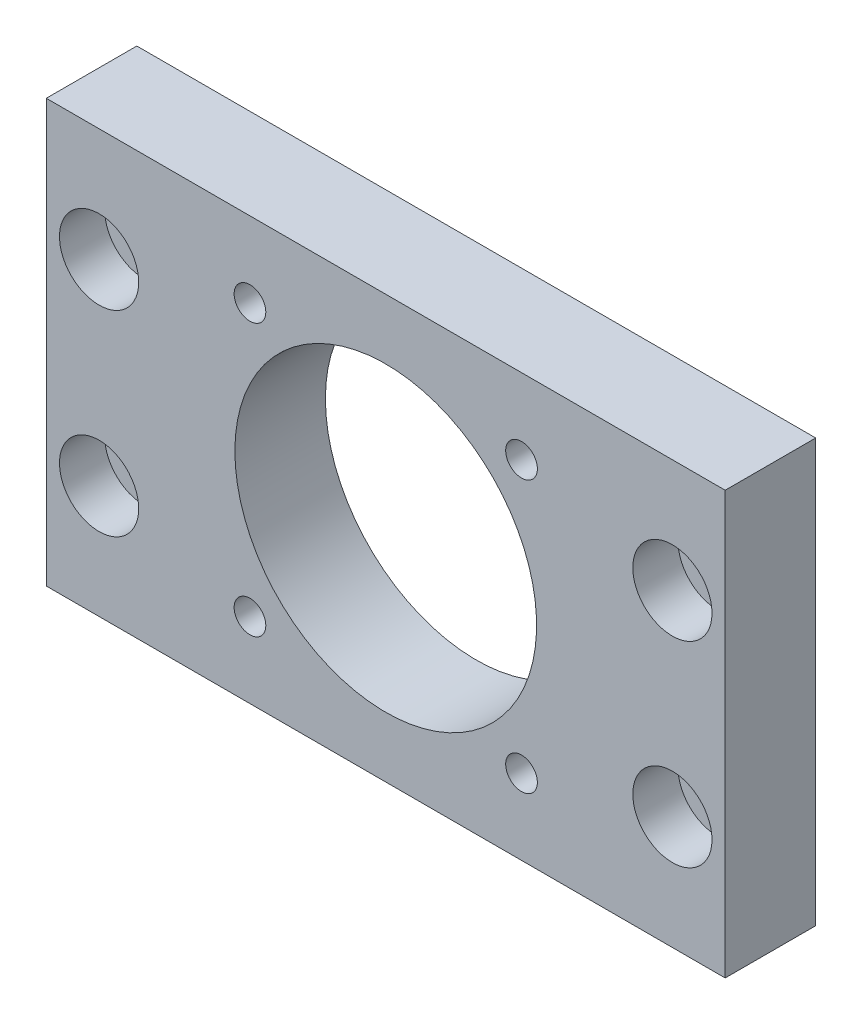
ISO-10303-21;
HEADER;
FILE_DESCRIPTION(('STEP AP214'),'2;1');
FILE_NAME('part.step','',(''),(''),'','','');
FILE_SCHEMA(('AUTOMOTIVE_DESIGN { 1 0 10303 214 1 1 1 1 }'));
ENDSEC;
DATA;
#1=APPLICATION_CONTEXT('core data for automotive mechanical design processes');
#2=APPLICATION_PROTOCOL_DEFINITION('international standard','automotive_design',2000,#1);
#3=PRODUCT_CONTEXT('',#1,'mechanical');
#4=PRODUCT('Part','Part','',(#3));
#5=PRODUCT_RELATED_PRODUCT_CATEGORY('part','',(#4));
#6=PRODUCT_DEFINITION_FORMATION('','',#4);
#7=PRODUCT_DEFINITION_CONTEXT('part definition',#1,'design');
#8=PRODUCT_DEFINITION('design','',#6,#7);
#9=PRODUCT_DEFINITION_SHAPE('','',#8);
#10=(LENGTH_UNIT() NAMED_UNIT(*) SI_UNIT(.MILLI.,.METRE.));
#11=(NAMED_UNIT(*) PLANE_ANGLE_UNIT() SI_UNIT($,.RADIAN.));
#12=(NAMED_UNIT(*) SI_UNIT($,.STERADIAN.) SOLID_ANGLE_UNIT());
#13=UNCERTAINTY_MEASURE_WITH_UNIT(LENGTH_MEASURE(1.E-05),#10,'distance_accuracy_value','');
#14=(GEOMETRIC_REPRESENTATION_CONTEXT(3) GLOBAL_UNCERTAINTY_ASSIGNED_CONTEXT((#13)) GLOBAL_UNIT_ASSIGNED_CONTEXT((#10,
#11,#12)) REPRESENTATION_CONTEXT('',''));
#15=CARTESIAN_POINT('',(0.,0.,0.));
#16=DIRECTION('',(0.,0.,1.));
#17=DIRECTION('',(1.,0.,0.));
#18=AXIS2_PLACEMENT_3D('',#15,#16,#17);
#19=CARTESIAN_POINT('',(38.,-13.,6.));
#20=DIRECTION('',(0.,0.,1.));
#21=DIRECTION('',(1.,0.,0.));
#22=AXIS2_PLACEMENT_3D('',#19,#20,#21);
#23=CYLINDRICAL_SURFACE('',#22,5.25);
#24=CARTESIAN_POINT('',(38.,-13.,0.));
#25=DIRECTION('',(0.,0.,1.));
#26=DIRECTION('',(1.,0.,0.));
#27=AXIS2_PLACEMENT_3D('',#24,#25,#26);
#28=CIRCLE('',#27,5.25);
#29=CARTESIAN_POINT('',(43.25,-13.,0.));
#30=VERTEX_POINT('',#29);
#31=EDGE_CURVE('E20',#30,#30,#28,.T.);
#32=ORIENTED_EDGE('',*,*,#31,.F.);
#33=EDGE_LOOP('',(#32));
#34=FACE_BOUND('',#33,.T.);
#35=CARTESIAN_POINT('',(38.,-13.,6.));
#36=DIRECTION('',(0.,0.,1.));
#37=DIRECTION('',(1.,0.,0.));
#38=AXIS2_PLACEMENT_3D('',#35,#36,#37);
#39=CIRCLE('',#38,5.25);
#40=CARTESIAN_POINT('',(43.25,-13.,6.));
#41=VERTEX_POINT('',#40);
#42=EDGE_CURVE('E156',#41,#41,#39,.F.);
#43=ORIENTED_EDGE('',*,*,#42,.F.);
#44=EDGE_LOOP('',(#43));
#45=FACE_BOUND('',#44,.T.);
#46=ADVANCED_FACE('F17',(#34,#45),#23,.F.);
#47=CARTESIAN_POINT('',(-38.,-13.,6.));
#48=DIRECTION('',(0.,0.,1.));
#49=DIRECTION('',(1.,0.,0.));
#50=AXIS2_PLACEMENT_3D('',#47,#48,#49);
#51=CYLINDRICAL_SURFACE('',#50,5.25);
#52=CARTESIAN_POINT('',(-38.,-13.,0.));
#53=DIRECTION('',(0.,0.,1.));
#54=DIRECTION('',(1.,0.,0.));
#55=AXIS2_PLACEMENT_3D('',#52,#53,#54);
#56=CIRCLE('',#55,5.25);
#57=CARTESIAN_POINT('',(-32.75,-13.,0.));
#58=VERTEX_POINT('',#57);
#59=EDGE_CURVE('E174',#58,#58,#56,.T.);
#60=ORIENTED_EDGE('',*,*,#59,.F.);
#61=EDGE_LOOP('',(#60));
#62=FACE_BOUND('',#61,.T.);
#63=CARTESIAN_POINT('',(-38.,-13.,6.));
#64=DIRECTION('',(0.,0.,1.));
#65=DIRECTION('',(1.,0.,0.));
#66=AXIS2_PLACEMENT_3D('',#63,#64,#65);
#67=CIRCLE('',#66,5.25);
#68=CARTESIAN_POINT('',(-32.75,-13.,6.));
#69=VERTEX_POINT('',#68);
#70=EDGE_CURVE('E153',#69,#69,#67,.F.);
#71=ORIENTED_EDGE('',*,*,#70,.F.);
#72=EDGE_LOOP('',(#71));
#73=FACE_BOUND('',#72,.T.);
#74=ADVANCED_FACE('F188',(#62,#73),#51,.F.);
#75=CARTESIAN_POINT('',(-38.,13.,6.));
#76=DIRECTION('',(0.,0.,1.));
#77=DIRECTION('',(1.,0.,0.));
#78=AXIS2_PLACEMENT_3D('',#75,#76,#77);
#79=CYLINDRICAL_SURFACE('',#78,5.25);
#80=CARTESIAN_POINT('',(-38.,13.,0.));
#81=DIRECTION('',(0.,0.,1.));
#82=DIRECTION('',(1.,0.,0.));
#83=AXIS2_PLACEMENT_3D('',#80,#81,#82);
#84=CIRCLE('',#83,5.25);
#85=CARTESIAN_POINT('',(-32.75,13.,0.));
#86=VERTEX_POINT('',#85);
#87=EDGE_CURVE('E171',#86,#86,#84,.T.);
#88=ORIENTED_EDGE('',*,*,#87,.F.);
#89=EDGE_LOOP('',(#88));
#90=FACE_BOUND('',#89,.T.);
#91=CARTESIAN_POINT('',(-38.,13.,6.));
#92=DIRECTION('',(0.,0.,1.));
#93=DIRECTION('',(1.,0.,0.));
#94=AXIS2_PLACEMENT_3D('',#91,#92,#93);
#95=CIRCLE('',#94,5.25);
#96=CARTESIAN_POINT('',(-32.75,13.,6.));
#97=VERTEX_POINT('',#96);
#98=EDGE_CURVE('E150',#97,#97,#95,.F.);
#99=ORIENTED_EDGE('',*,*,#98,.F.);
#100=EDGE_LOOP('',(#99));
#101=FACE_BOUND('',#100,.T.);
#102=ADVANCED_FACE('F299',(#90,#101),#79,.F.);
#103=CARTESIAN_POINT('',(38.,13.,6.));
#104=DIRECTION('',(0.,0.,1.));
#105=DIRECTION('',(1.,0.,0.));
#106=AXIS2_PLACEMENT_3D('',#103,#104,#105);
#107=CYLINDRICAL_SURFACE('',#106,5.25);
#108=CARTESIAN_POINT('',(38.,13.,0.));
#109=DIRECTION('',(0.,0.,1.));
#110=DIRECTION('',(1.,0.,0.));
#111=AXIS2_PLACEMENT_3D('',#108,#109,#110);
#112=CIRCLE('',#111,5.25);
#113=CARTESIAN_POINT('',(43.25,13.,0.));
#114=VERTEX_POINT('',#113);
#115=EDGE_CURVE('E176',#114,#114,#112,.T.);
#116=ORIENTED_EDGE('',*,*,#115,.F.);
#117=EDGE_LOOP('',(#116));
#118=FACE_BOUND('',#117,.T.);
#119=CARTESIAN_POINT('',(38.,13.,6.));
#120=DIRECTION('',(0.,0.,1.));
#121=DIRECTION('',(1.,0.,0.));
#122=AXIS2_PLACEMENT_3D('',#119,#120,#121);
#123=CIRCLE('',#122,5.25);
#124=CARTESIAN_POINT('',(43.25,13.,6.));
#125=VERTEX_POINT('',#124);
#126=EDGE_CURVE('E147',#125,#125,#123,.F.);
#127=ORIENTED_EDGE('',*,*,#126,.F.);
#128=EDGE_LOOP('',(#127));
#129=FACE_BOUND('',#128,.T.);
#130=ADVANCED_FACE('F295',(#118,#129),#107,.F.);
#131=CARTESIAN_POINT('',(18.,18.,-6.));
#132=DIRECTION('',(0.,0.,1.));
#133=DIRECTION('',(1.,0.,0.));
#134=AXIS2_PLACEMENT_3D('',#131,#132,#133);
#135=CYLINDRICAL_SURFACE('',#134,2.1);
#136=CARTESIAN_POINT('',(18.,18.,0.));
#137=DIRECTION('',(0.,0.,1.));
#138=DIRECTION('',(1.,0.,0.));
#139=AXIS2_PLACEMENT_3D('',#136,#137,#138);
#140=CIRCLE('',#139,2.1);
#141=CARTESIAN_POINT('',(20.1,18.,0.));
#142=VERTEX_POINT('',#141);
#143=EDGE_CURVE('E159',#142,#142,#140,.F.);
#144=ORIENTED_EDGE('',*,*,#143,.T.);
#145=EDGE_LOOP('',(#144));
#146=FACE_BOUND('',#145,.T.);
#147=CARTESIAN_POINT('',(18.,18.,6.));
#148=DIRECTION('',(0.,0.,1.));
#149=DIRECTION('',(1.,0.,0.));
#150=AXIS2_PLACEMENT_3D('',#147,#148,#149);
#151=CIRCLE('',#150,2.1);
#152=CARTESIAN_POINT('',(20.1,18.,6.));
#153=VERTEX_POINT('',#152);
#154=EDGE_CURVE('E144',#153,#153,#151,.F.);
#155=ORIENTED_EDGE('',*,*,#154,.F.);
#156=EDGE_LOOP('',(#155));
#157=FACE_BOUND('',#156,.T.);
#158=ADVANCED_FACE('F291',(#146,#157),#135,.F.);
#159=CARTESIAN_POINT('',(18.,-18.,-6.));
#160=DIRECTION('',(0.,0.,1.));
#161=DIRECTION('',(1.,0.,0.));
#162=AXIS2_PLACEMENT_3D('',#159,#160,#161);
#163=CYLINDRICAL_SURFACE('',#162,2.1);
#164=CARTESIAN_POINT('',(18.,-18.,0.));
#165=DIRECTION('',(0.,0.,1.));
#166=DIRECTION('',(1.,0.,0.));
#167=AXIS2_PLACEMENT_3D('',#164,#165,#166);
#168=CIRCLE('',#167,2.1);
#169=CARTESIAN_POINT('',(20.1,-18.,0.));
#170=VERTEX_POINT('',#169);
#171=EDGE_CURVE('E168',#170,#170,#168,.F.);
#172=ORIENTED_EDGE('',*,*,#171,.T.);
#173=EDGE_LOOP('',(#172));
#174=FACE_BOUND('',#173,.T.);
#175=CARTESIAN_POINT('',(18.,-18.,6.));
#176=DIRECTION('',(0.,0.,1.));
#177=DIRECTION('',(1.,0.,0.));
#178=AXIS2_PLACEMENT_3D('',#175,#176,#177);
#179=CIRCLE('',#178,2.1);
#180=CARTESIAN_POINT('',(20.1,-18.,6.));
#181=VERTEX_POINT('',#180);
#182=EDGE_CURVE('E141',#181,#181,#179,.F.);
#183=ORIENTED_EDGE('',*,*,#182,.F.);
#184=EDGE_LOOP('',(#183));
#185=FACE_BOUND('',#184,.T.);
#186=ADVANCED_FACE('F287',(#174,#185),#163,.F.);
#187=CARTESIAN_POINT('',(-18.,-18.,-6.));
#188=DIRECTION('',(0.,0.,1.));
#189=DIRECTION('',(1.,0.,0.));
#190=AXIS2_PLACEMENT_3D('',#187,#188,#189);
#191=CYLINDRICAL_SURFACE('',#190,2.1);
#192=CARTESIAN_POINT('',(-18.,-18.,0.));
#193=DIRECTION('',(0.,0.,1.));
#194=DIRECTION('',(1.,0.,0.));
#195=AXIS2_PLACEMENT_3D('',#192,#193,#194);
#196=CIRCLE('',#195,2.1);
#197=CARTESIAN_POINT('',(-15.9,-18.,0.));
#198=VERTEX_POINT('',#197);
#199=EDGE_CURVE('E165',#198,#198,#196,.F.);
#200=ORIENTED_EDGE('',*,*,#199,.T.);
#201=EDGE_LOOP('',(#200));
#202=FACE_BOUND('',#201,.T.);
#203=CARTESIAN_POINT('',(-18.,-18.,6.));
#204=DIRECTION('',(0.,0.,1.));
#205=DIRECTION('',(1.,0.,0.));
#206=AXIS2_PLACEMENT_3D('',#203,#204,#205);
#207=CIRCLE('',#206,2.1);
#208=CARTESIAN_POINT('',(-15.9,-18.,6.));
#209=VERTEX_POINT('',#208);
#210=EDGE_CURVE('E138',#209,#209,#207,.F.);
#211=ORIENTED_EDGE('',*,*,#210,.F.);
#212=EDGE_LOOP('',(#211));
#213=FACE_BOUND('',#212,.T.);
#214=ADVANCED_FACE('F283',(#202,#213),#191,.F.);
#215=CARTESIAN_POINT('',(-18.,18.,-6.));
#216=DIRECTION('',(0.,0.,1.));
#217=DIRECTION('',(1.,0.,0.));
#218=AXIS2_PLACEMENT_3D('',#215,#216,#217);
#219=CYLINDRICAL_SURFACE('',#218,2.1);
#220=CARTESIAN_POINT('',(-18.,18.,0.));
#221=DIRECTION('',(0.,0.,1.));
#222=DIRECTION('',(1.,0.,0.));
#223=AXIS2_PLACEMENT_3D('',#220,#221,#222);
#224=CIRCLE('',#223,2.1);
#225=CARTESIAN_POINT('',(-15.9,18.,0.));
#226=VERTEX_POINT('',#225);
#227=EDGE_CURVE('E162',#226,#226,#224,.F.);
#228=ORIENTED_EDGE('',*,*,#227,.T.);
#229=EDGE_LOOP('',(#228));
#230=FACE_BOUND('',#229,.T.);
#231=CARTESIAN_POINT('',(-18.,18.,6.));
#232=DIRECTION('',(0.,0.,1.));
#233=DIRECTION('',(1.,0.,0.));
#234=AXIS2_PLACEMENT_3D('',#231,#232,#233);
#235=CIRCLE('',#234,2.1);
#236=CARTESIAN_POINT('',(-15.9,18.,6.));
#237=VERTEX_POINT('',#236);
#238=EDGE_CURVE('E135',#237,#237,#235,.F.);
#239=ORIENTED_EDGE('',*,*,#238,.F.);
#240=EDGE_LOOP('',(#239));
#241=FACE_BOUND('',#240,.T.);
#242=ADVANCED_FACE('F277',(#230,#241),#219,.F.);
#243=CARTESIAN_POINT('',(0.,0.,0.));
#244=DIRECTION('',(0.,0.,1.));
#245=DIRECTION('',(1.,0.,0.));
#246=AXIS2_PLACEMENT_3D('',#243,#244,#245);
#247=PLANE('',#246);
#248=ORIENTED_EDGE('',*,*,#31,.T.);
#249=EDGE_LOOP('',(#248));
#250=FACE_BOUND('',#249,.T.);
#251=CARTESIAN_POINT('',(38.,-13.,0.));
#252=DIRECTION('',(0.,0.,1.));
#253=DIRECTION('',(1.,0.,0.));
#254=AXIS2_PLACEMENT_3D('',#251,#252,#253);
#255=CIRCLE('',#254,3.25);
#256=CARTESIAN_POINT('',(41.25,-13.,0.));
#257=VERTEX_POINT('',#256);
#258=EDGE_CURVE('E132',#257,#257,#255,.F.);
#259=ORIENTED_EDGE('',*,*,#258,.T.);
#260=EDGE_LOOP('',(#259));
#261=FACE_BOUND('',#260,.T.);
#262=ADVANCED_FACE('F183',(#250,#261),#247,.T.);
#263=CARTESIAN_POINT('',(0.,0.,0.));
#264=DIRECTION('',(0.,0.,1.));
#265=DIRECTION('',(1.,0.,0.));
#266=AXIS2_PLACEMENT_3D('',#263,#264,#265);
#267=PLANE('',#266);
#268=ORIENTED_EDGE('',*,*,#115,.T.);
#269=EDGE_LOOP('',(#268));
#270=FACE_BOUND('',#269,.T.);
#271=CARTESIAN_POINT('',(38.,13.,0.));
#272=DIRECTION('',(0.,0.,1.));
#273=DIRECTION('',(1.,0.,0.));
#274=AXIS2_PLACEMENT_3D('',#271,#272,#273);
#275=CIRCLE('',#274,3.25);
#276=CARTESIAN_POINT('',(41.25,13.,0.));
#277=VERTEX_POINT('',#276);
#278=EDGE_CURVE('E129',#277,#277,#275,.F.);
#279=ORIENTED_EDGE('',*,*,#278,.T.);
#280=EDGE_LOOP('',(#279));
#281=FACE_BOUND('',#280,.T.);
#282=ADVANCED_FACE('F266',(#270,#281),#267,.T.);
#283=CARTESIAN_POINT('',(0.,0.,0.));
#284=DIRECTION('',(0.,0.,1.));
#285=DIRECTION('',(1.,0.,0.));
#286=AXIS2_PLACEMENT_3D('',#283,#284,#285);
#287=PLANE('',#286);
#288=ORIENTED_EDGE('',*,*,#59,.T.);
#289=EDGE_LOOP('',(#288));
#290=FACE_BOUND('',#289,.T.);
#291=CARTESIAN_POINT('',(-38.,-13.,0.));
#292=DIRECTION('',(0.,0.,1.));
#293=DIRECTION('',(1.,0.,0.));
#294=AXIS2_PLACEMENT_3D('',#291,#292,#293);
#295=CIRCLE('',#294,3.25);
#296=CARTESIAN_POINT('',(-34.75,-13.,0.));
#297=VERTEX_POINT('',#296);
#298=EDGE_CURVE('E126',#297,#297,#295,.F.);
#299=ORIENTED_EDGE('',*,*,#298,.T.);
#300=EDGE_LOOP('',(#299));
#301=FACE_BOUND('',#300,.T.);
#302=ADVANCED_FACE('F268',(#290,#301),#287,.T.);
#303=CARTESIAN_POINT('',(0.,0.,0.));
#304=DIRECTION('',(0.,0.,1.));
#305=DIRECTION('',(1.,0.,0.));
#306=AXIS2_PLACEMENT_3D('',#303,#304,#305);
#307=PLANE('',#306);
#308=ORIENTED_EDGE('',*,*,#87,.T.);
#309=EDGE_LOOP('',(#308));
#310=FACE_BOUND('',#309,.T.);
#311=CARTESIAN_POINT('',(-38.,13.,0.));
#312=DIRECTION('',(0.,0.,1.));
#313=DIRECTION('',(1.,0.,0.));
#314=AXIS2_PLACEMENT_3D('',#311,#312,#313);
#315=CIRCLE('',#314,3.25);
#316=CARTESIAN_POINT('',(-34.75,13.,0.));
#317=VERTEX_POINT('',#316);
#318=EDGE_CURVE('E123',#317,#317,#315,.F.);
#319=ORIENTED_EDGE('',*,*,#318,.T.);
#320=EDGE_LOOP('',(#319));
#321=FACE_BOUND('',#320,.T.);
#322=ADVANCED_FACE('F274',(#310,#321),#307,.T.);
#323=CARTESIAN_POINT('',(18.,-18.,0.));
#324=DIRECTION('',(0.,0.,1.));
#325=DIRECTION('',(1.,0.,0.));
#326=AXIS2_PLACEMENT_3D('',#323,#324,#325);
#327=PLANE('',#326);
#328=CARTESIAN_POINT('',(18.,-18.,0.));
#329=DIRECTION('',(0.,0.,1.));
#330=DIRECTION('',(1.,0.,0.));
#331=AXIS2_PLACEMENT_3D('',#328,#329,#330);
#332=CIRCLE('',#331,3.75);
#333=CARTESIAN_POINT('',(21.75,-18.,0.));
#334=VERTEX_POINT('',#333);
#335=EDGE_CURVE('E117',#334,#334,#332,.F.);
#336=ORIENTED_EDGE('',*,*,#335,.T.);
#337=EDGE_LOOP('',(#336));
#338=FACE_BOUND('',#337,.T.);
#339=ORIENTED_EDGE('',*,*,#171,.F.);
#340=EDGE_LOOP('',(#339));
#341=FACE_BOUND('',#340,.T.);
#342=ADVANCED_FACE('F371',(#338,#341),#327,.F.);
#343=CARTESIAN_POINT('',(-18.,-18.,0.));
#344=DIRECTION('',(0.,0.,1.));
#345=DIRECTION('',(1.,0.,0.));
#346=AXIS2_PLACEMENT_3D('',#343,#344,#345);
#347=PLANE('',#346);
#348=CARTESIAN_POINT('',(-18.,-18.,0.));
#349=DIRECTION('',(0.,0.,1.));
#350=DIRECTION('',(1.,0.,0.));
#351=AXIS2_PLACEMENT_3D('',#348,#349,#350);
#352=CIRCLE('',#351,3.75);
#353=CARTESIAN_POINT('',(-14.25,-18.,0.));
#354=VERTEX_POINT('',#353);
#355=EDGE_CURVE('E114',#354,#354,#352,.F.);
#356=ORIENTED_EDGE('',*,*,#355,.T.);
#357=EDGE_LOOP('',(#356));
#358=FACE_BOUND('',#357,.T.);
#359=ORIENTED_EDGE('',*,*,#199,.F.);
#360=EDGE_LOOP('',(#359));
#361=FACE_BOUND('',#360,.T.);
#362=ADVANCED_FACE('F380',(#358,#361),#347,.F.);
#363=CARTESIAN_POINT('',(-18.,18.,0.));
#364=DIRECTION('',(0.,0.,1.));
#365=DIRECTION('',(1.,0.,0.));
#366=AXIS2_PLACEMENT_3D('',#363,#364,#365);
#367=PLANE('',#366);
#368=CARTESIAN_POINT('',(-18.,18.,0.));
#369=DIRECTION('',(0.,0.,1.));
#370=DIRECTION('',(1.,0.,0.));
#371=AXIS2_PLACEMENT_3D('',#368,#369,#370);
#372=CIRCLE('',#371,3.75);
#373=CARTESIAN_POINT('',(-14.25,18.,0.));
#374=VERTEX_POINT('',#373);
#375=EDGE_CURVE('E111',#374,#374,#372,.F.);
#376=ORIENTED_EDGE('',*,*,#375,.T.);
#377=EDGE_LOOP('',(#376));
#378=FACE_BOUND('',#377,.T.);
#379=ORIENTED_EDGE('',*,*,#227,.F.);
#380=EDGE_LOOP('',(#379));
#381=FACE_BOUND('',#380,.T.);
#382=ADVANCED_FACE('F203',(#378,#381),#367,.F.);
#383=CARTESIAN_POINT('',(18.,18.,0.));
#384=DIRECTION('',(0.,0.,1.));
#385=DIRECTION('',(1.,0.,0.));
#386=AXIS2_PLACEMENT_3D('',#383,#384,#385);
#387=PLANE('',#386);
#388=CARTESIAN_POINT('',(18.,18.,0.));
#389=DIRECTION('',(0.,0.,1.));
#390=DIRECTION('',(1.,0.,0.));
#391=AXIS2_PLACEMENT_3D('',#388,#389,#390);
#392=CIRCLE('',#391,3.75);
#393=CARTESIAN_POINT('',(21.75,18.,0.));
#394=VERTEX_POINT('',#393);
#395=EDGE_CURVE('E67',#394,#394,#392,.F.);
#396=ORIENTED_EDGE('',*,*,#395,.T.);
#397=EDGE_LOOP('',(#396));
#398=FACE_BOUND('',#397,.T.);
#399=ORIENTED_EDGE('',*,*,#143,.F.);
#400=EDGE_LOOP('',(#399));
#401=FACE_BOUND('',#400,.T.);
#402=ADVANCED_FACE('F193',(#398,#401),#387,.F.);
#403=CARTESIAN_POINT('',(0.,0.,6.));
#404=DIRECTION('',(0.,0.,1.));
#405=DIRECTION('',(1.,0.,0.));
#406=AXIS2_PLACEMENT_3D('',#403,#404,#405);
#407=PLANE('',#406);
#408=DIRECTION('',(1.,0.,0.));
#409=VECTOR('',#408,1.);
#410=CARTESIAN_POINT('',(-45.,-28.,6.));
#411=LINE('',#410,#409);
#412=CARTESIAN_POINT('',(45.,-28.,6.));
#413=VERTEX_POINT('',#412);
#414=CARTESIAN_POINT('',(-45.,-28.,6.));
#415=VERTEX_POINT('',#414);
#416=EDGE_CURVE('E569',#413,#415,#411,.F.);
#417=ORIENTED_EDGE('',*,*,#416,.F.);
#418=DIRECTION('',(0.,1.,0.));
#419=VECTOR('',#418,1.);
#420=CARTESIAN_POINT('',(45.,-28.,6.));
#421=LINE('',#420,#419);
#422=CARTESIAN_POINT('',(45.,28.,6.));
#423=VERTEX_POINT('',#422);
#424=EDGE_CURVE('E61',#423,#413,#421,.F.);
#425=ORIENTED_EDGE('',*,*,#424,.F.);
#426=DIRECTION('',(1.,0.,0.));
#427=VECTOR('',#426,1.);
#428=CARTESIAN_POINT('',(45.,28.,6.));
#429=LINE('',#428,#427);
#430=CARTESIAN_POINT('',(-45.,28.,6.));
#431=VERTEX_POINT('',#430);
#432=EDGE_CURVE('E58',#431,#423,#429,.T.);
#433=ORIENTED_EDGE('',*,*,#432,.F.);
#434=DIRECTION('',(0.,1.,0.));
#435=VECTOR('',#434,1.);
#436=CARTESIAN_POINT('',(-45.,28.,6.));
#437=LINE('',#436,#435);
#438=EDGE_CURVE('E55',#415,#431,#437,.T.);
#439=ORIENTED_EDGE('',*,*,#438,.F.);
#440=EDGE_LOOP('',(#417,#425,#433,#439));
#441=FACE_BOUND('',#440,.T.);
#442=ORIENTED_EDGE('',*,*,#238,.T.);
#443=EDGE_LOOP('',(#442));
#444=FACE_BOUND('',#443,.T.);
#445=ORIENTED_EDGE('',*,*,#210,.T.);
#446=EDGE_LOOP('',(#445));
#447=FACE_BOUND('',#446,.T.);
#448=ORIENTED_EDGE('',*,*,#182,.T.);
#449=EDGE_LOOP('',(#448));
#450=FACE_BOUND('',#449,.T.);
#451=ORIENTED_EDGE('',*,*,#154,.T.);
#452=EDGE_LOOP('',(#451));
#453=FACE_BOUND('',#452,.T.);
#454=CARTESIAN_POINT('',(0.,0.,6.));
#455=DIRECTION('',(0.,0.,-1.));
#456=DIRECTION('',(-1.,0.,0.));
#457=AXIS2_PLACEMENT_3D('',#454,#455,#456);
#458=CIRCLE('',#457,20.);
#459=CARTESIAN_POINT('',(-20.,0.,6.));
#460=VERTEX_POINT('',#459);
#461=EDGE_CURVE('E120',#460,#460,#458,.T.);
#462=ORIENTED_EDGE('',*,*,#461,.T.);
#463=EDGE_LOOP('',(#462));
#464=FACE_BOUND('',#463,.T.);
#465=ORIENTED_EDGE('',*,*,#126,.T.);
#466=EDGE_LOOP('',(#465));
#467=FACE_BOUND('',#466,.T.);
#468=ORIENTED_EDGE('',*,*,#98,.T.);
#469=EDGE_LOOP('',(#468));
#470=FACE_BOUND('',#469,.T.);
#471=ORIENTED_EDGE('',*,*,#70,.T.);
#472=EDGE_LOOP('',(#471));
#473=FACE_BOUND('',#472,.T.);
#474=ORIENTED_EDGE('',*,*,#42,.T.);
#475=EDGE_LOOP('',(#474));
#476=FACE_BOUND('',#475,.T.);
#477=ADVANCED_FACE('F59',(#441,#444,#447,#450,#453,#464,#467,#470,#473,#476),#407,.T.);
#478=CARTESIAN_POINT('',(38.,-13.,6.));
#479=DIRECTION('',(0.,0.,1.));
#480=DIRECTION('',(1.,0.,0.));
#481=AXIS2_PLACEMENT_3D('',#478,#479,#480);
#482=CYLINDRICAL_SURFACE('',#481,3.25);
#483=ORIENTED_EDGE('',*,*,#258,.F.);
#484=EDGE_LOOP('',(#483));
#485=FACE_BOUND('',#484,.T.);
#486=CARTESIAN_POINT('',(38.,-13.,-6.));
#487=DIRECTION('',(0.,0.,1.));
#488=DIRECTION('',(1.,0.,0.));
#489=AXIS2_PLACEMENT_3D('',#486,#487,#488);
#490=CIRCLE('',#489,3.25);
#491=CARTESIAN_POINT('',(41.25,-13.,-6.));
#492=VERTEX_POINT('',#491);
#493=EDGE_CURVE('E106',#492,#492,#490,.F.);
#494=ORIENTED_EDGE('',*,*,#493,.T.);
#495=EDGE_LOOP('',(#494));
#496=FACE_BOUND('',#495,.T.);
#497=ADVANCED_FACE('F192',(#485,#496),#482,.F.);
#498=CARTESIAN_POINT('',(38.,13.,6.));
#499=DIRECTION('',(0.,0.,1.));
#500=DIRECTION('',(1.,0.,0.));
#501=AXIS2_PLACEMENT_3D('',#498,#499,#500);
#502=CYLINDRICAL_SURFACE('',#501,3.25);
#503=ORIENTED_EDGE('',*,*,#278,.F.);
#504=EDGE_LOOP('',(#503));
#505=FACE_BOUND('',#504,.T.);
#506=CARTESIAN_POINT('',(38.,13.,-6.));
#507=DIRECTION('',(0.,0.,1.));
#508=DIRECTION('',(1.,0.,0.));
#509=AXIS2_PLACEMENT_3D('',#506,#507,#508);
#510=CIRCLE('',#509,3.25);
#511=CARTESIAN_POINT('',(41.25,13.,-6.));
#512=VERTEX_POINT('',#511);
#513=EDGE_CURVE('E103',#512,#512,#510,.F.);
#514=ORIENTED_EDGE('',*,*,#513,.T.);
#515=EDGE_LOOP('',(#514));
#516=FACE_BOUND('',#515,.T.);
#517=ADVANCED_FACE('F200',(#505,#516),#502,.F.);
#518=CARTESIAN_POINT('',(-38.,-13.,6.));
#519=DIRECTION('',(0.,0.,1.));
#520=DIRECTION('',(1.,0.,0.));
#521=AXIS2_PLACEMENT_3D('',#518,#519,#520);
#522=CYLINDRICAL_SURFACE('',#521,3.25);
#523=ORIENTED_EDGE('',*,*,#298,.F.);
#524=EDGE_LOOP('',(#523));
#525=FACE_BOUND('',#524,.T.);
#526=CARTESIAN_POINT('',(-38.,-13.,-6.));
#527=DIRECTION('',(0.,0.,1.));
#528=DIRECTION('',(1.,0.,0.));
#529=AXIS2_PLACEMENT_3D('',#526,#527,#528);
#530=CIRCLE('',#529,3.25);
#531=CARTESIAN_POINT('',(-34.75,-13.,-6.));
#532=VERTEX_POINT('',#531);
#533=EDGE_CURVE('E100',#532,#532,#530,.F.);
#534=ORIENTED_EDGE('',*,*,#533,.T.);
#535=EDGE_LOOP('',(#534));
#536=FACE_BOUND('',#535,.T.);
#537=ADVANCED_FACE('F249',(#525,#536),#522,.F.);
#538=CARTESIAN_POINT('',(-38.,13.,6.));
#539=DIRECTION('',(0.,0.,1.));
#540=DIRECTION('',(1.,0.,0.));
#541=AXIS2_PLACEMENT_3D('',#538,#539,#540);
#542=CYLINDRICAL_SURFACE('',#541,3.25);
#543=ORIENTED_EDGE('',*,*,#318,.F.);
#544=EDGE_LOOP('',(#543));
#545=FACE_BOUND('',#544,.T.);
#546=CARTESIAN_POINT('',(-38.,13.,-6.));
#547=DIRECTION('',(0.,0.,1.));
#548=DIRECTION('',(1.,0.,0.));
#549=AXIS2_PLACEMENT_3D('',#546,#547,#548);
#550=CIRCLE('',#549,3.25);
#551=CARTESIAN_POINT('',(-34.75,13.,-6.));
#552=VERTEX_POINT('',#551);
#553=EDGE_CURVE('E97',#552,#552,#550,.F.);
#554=ORIENTED_EDGE('',*,*,#553,.T.);
#555=EDGE_LOOP('',(#554));
#556=FACE_BOUND('',#555,.T.);
#557=ADVANCED_FACE('F245',(#545,#556),#542,.F.);
#558=CARTESIAN_POINT('',(0.,0.,6.));
#559=DIRECTION('',(0.,0.,-1.));
#560=DIRECTION('',(-1.,0.,0.));
#561=AXIS2_PLACEMENT_3D('',#558,#559,#560);
#562=CYLINDRICAL_SURFACE('',#561,20.);
#563=ORIENTED_EDGE('',*,*,#461,.F.);
#564=EDGE_LOOP('',(#563));
#565=FACE_BOUND('',#564,.T.);
#566=CARTESIAN_POINT('',(0.,0.,-6.));
#567=DIRECTION('',(0.,0.,-1.));
#568=DIRECTION('',(-1.,0.,0.));
#569=AXIS2_PLACEMENT_3D('',#566,#567,#568);
#570=CIRCLE('',#569,20.);
#571=CARTESIAN_POINT('',(-20.,0.,-6.));
#572=VERTEX_POINT('',#571);
#573=EDGE_CURVE('E94',#572,#572,#570,.T.);
#574=ORIENTED_EDGE('',*,*,#573,.T.);
#575=EDGE_LOOP('',(#574));
#576=FACE_BOUND('',#575,.T.);
#577=ADVANCED_FACE('F241',(#565,#576),#562,.F.);
#578=CARTESIAN_POINT('',(18.,-18.,-6.));
#579=DIRECTION('',(0.,0.,1.));
#580=DIRECTION('',(1.,0.,0.));
#581=AXIS2_PLACEMENT_3D('',#578,#579,#580);
#582=CYLINDRICAL_SURFACE('',#581,3.75);
#583=ORIENTED_EDGE('',*,*,#335,.F.);
#584=EDGE_LOOP('',(#583));
#585=FACE_BOUND('',#584,.T.);
#586=CARTESIAN_POINT('',(18.,-18.,-6.));
#587=DIRECTION('',(0.,0.,1.));
#588=DIRECTION('',(1.,0.,0.));
#589=AXIS2_PLACEMENT_3D('',#586,#587,#588);
#590=CIRCLE('',#589,3.75);
#591=CARTESIAN_POINT('',(21.75,-18.,-6.));
#592=VERTEX_POINT('',#591);
#593=EDGE_CURVE('E91',#592,#592,#590,.F.);
#594=ORIENTED_EDGE('',*,*,#593,.T.);
#595=EDGE_LOOP('',(#594));
#596=FACE_BOUND('',#595,.T.);
#597=ADVANCED_FACE('F237',(#585,#596),#582,.F.);
#598=CARTESIAN_POINT('',(-18.,-18.,-6.));
#599=DIRECTION('',(0.,0.,1.));
#600=DIRECTION('',(1.,0.,0.));
#601=AXIS2_PLACEMENT_3D('',#598,#599,#600);
#602=CYLINDRICAL_SURFACE('',#601,3.75);
#603=ORIENTED_EDGE('',*,*,#355,.F.);
#604=EDGE_LOOP('',(#603));
#605=FACE_BOUND('',#604,.T.);
#606=CARTESIAN_POINT('',(-18.,-18.,-6.));
#607=DIRECTION('',(0.,0.,1.));
#608=DIRECTION('',(1.,0.,0.));
#609=AXIS2_PLACEMENT_3D('',#606,#607,#608);
#610=CIRCLE('',#609,3.75);
#611=CARTESIAN_POINT('',(-14.25,-18.,-6.));
#612=VERTEX_POINT('',#611);
#613=EDGE_CURVE('E88',#612,#612,#610,.F.);
#614=ORIENTED_EDGE('',*,*,#613,.T.);
#615=EDGE_LOOP('',(#614));
#616=FACE_BOUND('',#615,.T.);
#617=ADVANCED_FACE('F233',(#605,#616),#602,.F.);
#618=CARTESIAN_POINT('',(-18.,18.,-6.));
#619=DIRECTION('',(0.,0.,1.));
#620=DIRECTION('',(1.,0.,0.));
#621=AXIS2_PLACEMENT_3D('',#618,#619,#620);
#622=CYLINDRICAL_SURFACE('',#621,3.75);
#623=ORIENTED_EDGE('',*,*,#375,.F.);
#624=EDGE_LOOP('',(#623));
#625=FACE_BOUND('',#624,.T.);
#626=CARTESIAN_POINT('',(-18.,18.,-6.));
#627=DIRECTION('',(0.,0.,1.));
#628=DIRECTION('',(1.,0.,0.));
#629=AXIS2_PLACEMENT_3D('',#626,#627,#628);
#630=CIRCLE('',#629,3.75);
#631=CARTESIAN_POINT('',(-14.25,18.,-6.));
#632=VERTEX_POINT('',#631);
#633=EDGE_CURVE('E85',#632,#632,#630,.F.);
#634=ORIENTED_EDGE('',*,*,#633,.T.);
#635=EDGE_LOOP('',(#634));
#636=FACE_BOUND('',#635,.T.);
#637=ADVANCED_FACE('F229',(#625,#636),#622,.F.);
#638=CARTESIAN_POINT('',(18.,18.,-6.));
#639=DIRECTION('',(0.,0.,1.));
#640=DIRECTION('',(1.,0.,0.));
#641=AXIS2_PLACEMENT_3D('',#638,#639,#640);
#642=CYLINDRICAL_SURFACE('',#641,3.75);
#643=ORIENTED_EDGE('',*,*,#395,.F.);
#644=EDGE_LOOP('',(#643));
#645=FACE_BOUND('',#644,.T.);
#646=CARTESIAN_POINT('',(18.,18.,-6.));
#647=DIRECTION('',(0.,0.,1.));
#648=DIRECTION('',(1.,0.,0.));
#649=AXIS2_PLACEMENT_3D('',#646,#647,#648);
#650=CIRCLE('',#649,3.75);
#651=CARTESIAN_POINT('',(21.75,18.,-6.));
#652=VERTEX_POINT('',#651);
#653=EDGE_CURVE('E82',#652,#652,#650,.F.);
#654=ORIENTED_EDGE('',*,*,#653,.T.);
#655=EDGE_LOOP('',(#654));
#656=FACE_BOUND('',#655,.T.);
#657=ADVANCED_FACE('F226',(#645,#656),#642,.F.);
#658=CARTESIAN_POINT('',(45.,28.,-6.));
#659=DIRECTION('',(0.,1.,0.));
#660=DIRECTION('',(0.,0.,1.));
#661=AXIS2_PLACEMENT_3D('',#658,#659,#660);
#662=PLANE('',#661);
#663=DIRECTION('',(0.,0.,1.));
#664=VECTOR('',#663,1.);
#665=CARTESIAN_POINT('',(-45.,28.,-6.));
#666=LINE('',#665,#664);
#667=CARTESIAN_POINT('',(-45.,28.,-6.));
#668=VERTEX_POINT('',#667);
#669=EDGE_CURVE('E66',#431,#668,#666,.F.);
#670=ORIENTED_EDGE('',*,*,#669,.F.);
#671=ORIENTED_EDGE('',*,*,#432,.T.);
#672=DIRECTION('',(0.,0.,-1.));
#673=VECTOR('',#672,1.);
#674=CARTESIAN_POINT('',(45.,28.,-6.));
#675=LINE('',#674,#673);
#676=CARTESIAN_POINT('',(45.,28.,-6.));
#677=VERTEX_POINT('',#676);
#678=EDGE_CURVE('E570',#677,#423,#675,.F.);
#679=ORIENTED_EDGE('',*,*,#678,.F.);
#680=DIRECTION('',(1.,0.,0.));
#681=VECTOR('',#680,1.);
#682=CARTESIAN_POINT('',(0.,28.,-6.));
#683=LINE('',#682,#681);
#684=EDGE_CURVE('E78',#677,#668,#683,.F.);
#685=ORIENTED_EDGE('',*,*,#684,.T.);
#686=EDGE_LOOP('',(#670,#671,#679,#685));
#687=FACE_BOUND('',#686,.T.);
#688=ADVANCED_FACE('F77',(#687),#662,.T.);
#689=CARTESIAN_POINT('',(-45.,28.,-6.));
#690=DIRECTION('',(-1.,0.,0.));
#691=DIRECTION('',(0.,0.,1.));
#692=AXIS2_PLACEMENT_3D('',#689,#690,#691);
#693=PLANE('',#692);
#694=DIRECTION('',(0.,0.,-1.));
#695=VECTOR('',#694,1.);
#696=CARTESIAN_POINT('',(-45.,-28.,-6.));
#697=LINE('',#696,#695);
#698=CARTESIAN_POINT('',(-45.,-28.,-6.));
#699=VERTEX_POINT('',#698);
#700=EDGE_CURVE('E74',#415,#699,#697,.T.);
#701=ORIENTED_EDGE('',*,*,#700,.F.);
#702=ORIENTED_EDGE('',*,*,#438,.T.);
#703=ORIENTED_EDGE('',*,*,#669,.T.);
#704=DIRECTION('',(0.,1.,0.));
#705=VECTOR('',#704,1.);
#706=CARTESIAN_POINT('',(-45.,0.,-6.));
#707=LINE('',#706,#705);
#708=EDGE_CURVE('E575',#668,#699,#707,.F.);
#709=ORIENTED_EDGE('',*,*,#708,.T.);
#710=EDGE_LOOP('',(#701,#702,#703,#709));
#711=FACE_BOUND('',#710,.T.);
#712=ADVANCED_FACE('F71',(#711),#693,.T.);
#713=CARTESIAN_POINT('',(-45.,-28.,-6.));
#714=DIRECTION('',(0.,-1.,0.));
#715=DIRECTION('',(0.,0.,-1.));
#716=AXIS2_PLACEMENT_3D('',#713,#714,#715);
#717=PLANE('',#716);
#718=DIRECTION('',(0.,0.,-1.));
#719=VECTOR('',#718,1.);
#720=CARTESIAN_POINT('',(45.,-28.,-6.));
#721=LINE('',#720,#719);
#722=CARTESIAN_POINT('',(45.,-28.,-6.));
#723=VERTEX_POINT('',#722);
#724=EDGE_CURVE('E34',#413,#723,#721,.T.);
#725=ORIENTED_EDGE('',*,*,#724,.F.);
#726=ORIENTED_EDGE('',*,*,#416,.T.);
#727=ORIENTED_EDGE('',*,*,#700,.T.);
#728=DIRECTION('',(1.,0.,0.));
#729=VECTOR('',#728,1.);
#730=CARTESIAN_POINT('',(0.,-28.,-6.));
#731=LINE('',#730,#729);
#732=EDGE_CURVE('E26',#699,#723,#731,.T.);
#733=ORIENTED_EDGE('',*,*,#732,.T.);
#734=EDGE_LOOP('',(#725,#726,#727,#733));
#735=FACE_BOUND('',#734,.T.);
#736=ADVANCED_FACE('F214',(#735),#717,.T.);
#737=CARTESIAN_POINT('',(45.,-28.,-6.));
#738=DIRECTION('',(1.,0.,0.));
#739=DIRECTION('',(0.,0.,-1.));
#740=AXIS2_PLACEMENT_3D('',#737,#738,#739);
#741=PLANE('',#740);
#742=ORIENTED_EDGE('',*,*,#678,.T.);
#743=ORIENTED_EDGE('',*,*,#424,.T.);
#744=ORIENTED_EDGE('',*,*,#724,.T.);
#745=DIRECTION('',(0.,1.,0.));
#746=VECTOR('',#745,1.);
#747=CARTESIAN_POINT('',(45.,0.,-6.));
#748=LINE('',#747,#746);
#749=EDGE_CURVE('E11',#723,#677,#748,.T.);
#750=ORIENTED_EDGE('',*,*,#749,.T.);
#751=EDGE_LOOP('',(#742,#743,#744,#750));
#752=FACE_BOUND('',#751,.T.);
#753=ADVANCED_FACE('F208',(#752),#741,.T.);
#754=CARTESIAN_POINT('',(0.,0.,-6.));
#755=DIRECTION('',(0.,0.,1.));
#756=DIRECTION('',(1.,0.,0.));
#757=AXIS2_PLACEMENT_3D('',#754,#755,#756);
#758=PLANE('',#757);
#759=ORIENTED_EDGE('',*,*,#732,.F.);
#760=ORIENTED_EDGE('',*,*,#708,.F.);
#761=ORIENTED_EDGE('',*,*,#684,.F.);
#762=ORIENTED_EDGE('',*,*,#749,.F.);
#763=EDGE_LOOP('',(#759,#760,#761,#762));
#764=FACE_BOUND('',#763,.T.);
#765=ORIENTED_EDGE('',*,*,#653,.F.);
#766=EDGE_LOOP('',(#765));
#767=FACE_BOUND('',#766,.T.);
#768=ORIENTED_EDGE('',*,*,#633,.F.);
#769=EDGE_LOOP('',(#768));
#770=FACE_BOUND('',#769,.T.);
#771=ORIENTED_EDGE('',*,*,#613,.F.);
#772=EDGE_LOOP('',(#771));
#773=FACE_BOUND('',#772,.T.);
#774=ORIENTED_EDGE('',*,*,#593,.F.);
#775=EDGE_LOOP('',(#774));
#776=FACE_BOUND('',#775,.T.);
#777=ORIENTED_EDGE('',*,*,#573,.F.);
#778=EDGE_LOOP('',(#777));
#779=FACE_BOUND('',#778,.T.);
#780=ORIENTED_EDGE('',*,*,#553,.F.);
#781=EDGE_LOOP('',(#780));
#782=FACE_BOUND('',#781,.T.);
#783=ORIENTED_EDGE('',*,*,#533,.F.);
#784=EDGE_LOOP('',(#783));
#785=FACE_BOUND('',#784,.T.);
#786=ORIENTED_EDGE('',*,*,#513,.F.);
#787=EDGE_LOOP('',(#786));
#788=FACE_BOUND('',#787,.T.);
#789=ORIENTED_EDGE('',*,*,#493,.F.);
#790=EDGE_LOOP('',(#789));
#791=FACE_BOUND('',#790,.T.);
#792=ADVANCED_FACE('F206',(#764,#767,#770,#773,#776,#779,#782,#785,#788,#791),#758,.F.);
#793=CLOSED_SHELL('',(#46,#74,#102,#130,#158,#186,#214,#242,#262,#282,#302,#322,#342,#362,#382,
#402,#477,#497,#517,#537,#557,#577,#597,#617,#637,#657,#688,#712,#736,#753,#792));
#794=MANIFOLD_SOLID_BREP('B1',#793);
#795=ADVANCED_BREP_SHAPE_REPRESENTATION('',(#18,#794),#14);
#796=SHAPE_DEFINITION_REPRESENTATION(#9,#795);
ENDSEC;
END-ISO-10303-21;
